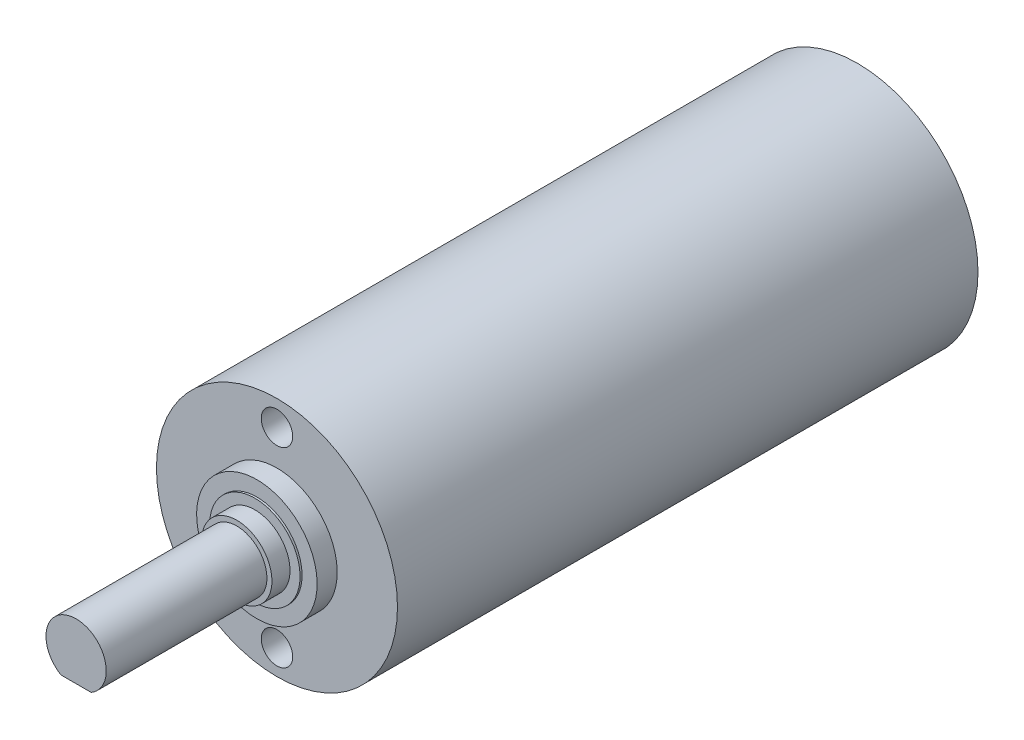
ISO-10303-21;
HEADER;
FILE_DESCRIPTION(('STEP AP214'),'2;1');
FILE_NAME('part.step','',(''),(''),'','','');
FILE_SCHEMA(('AUTOMOTIVE_DESIGN { 1 0 10303 214 1 1 1 1 }'));
ENDSEC;
DATA;
#1=APPLICATION_CONTEXT('core data for automotive mechanical design processes');
#2=APPLICATION_PROTOCOL_DEFINITION('international standard','automotive_design',2000,#1);
#3=PRODUCT_CONTEXT('',#1,'mechanical');
#4=PRODUCT('Part','Part','',(#3));
#5=PRODUCT_RELATED_PRODUCT_CATEGORY('part','',(#4));
#6=PRODUCT_DEFINITION_FORMATION('','',#4);
#7=PRODUCT_DEFINITION_CONTEXT('part definition',#1,'design');
#8=PRODUCT_DEFINITION('design','',#6,#7);
#9=PRODUCT_DEFINITION_SHAPE('','',#8);
#10=(LENGTH_UNIT() NAMED_UNIT(*) SI_UNIT(.MILLI.,.METRE.));
#11=(NAMED_UNIT(*) PLANE_ANGLE_UNIT() SI_UNIT($,.RADIAN.));
#12=(NAMED_UNIT(*) SI_UNIT($,.STERADIAN.) SOLID_ANGLE_UNIT());
#13=UNCERTAINTY_MEASURE_WITH_UNIT(LENGTH_MEASURE(1.E-05),#10,'distance_accuracy_value','');
#14=(GEOMETRIC_REPRESENTATION_CONTEXT(3) GLOBAL_UNCERTAINTY_ASSIGNED_CONTEXT((#13)) GLOBAL_UNIT_ASSIGNED_CONTEXT((#10,
#11,#12)) REPRESENTATION_CONTEXT('',''));
#15=CARTESIAN_POINT('',(0.,0.,0.));
#16=DIRECTION('',(0.,0.,1.));
#17=DIRECTION('',(1.,0.,0.));
#18=AXIS2_PLACEMENT_3D('',#15,#16,#17);
#19=CARTESIAN_POINT('',(0.,4.75,-1.));
#20=DIRECTION('',(0.,0.,-1.));
#21=DIRECTION('',(1.,0.,0.));
#22=AXIS2_PLACEMENT_3D('',#19,#20,#21);
#23=CYLINDRICAL_SURFACE('',#22,0.7835);
#24=CARTESIAN_POINT('',(0.,4.75,0.));
#25=DIRECTION('',(0.,0.,-1.));
#26=DIRECTION('',(1.,0.,0.));
#27=AXIS2_PLACEMENT_3D('',#24,#25,#26);
#28=CIRCLE('',#27,0.7835);
#29=CARTESIAN_POINT('',(0.7835,4.75,0.));
#30=VERTEX_POINT('',#29);
#31=EDGE_CURVE('E39',#30,#30,#28,.T.);
#32=ORIENTED_EDGE('',*,*,#31,.F.);
#33=EDGE_LOOP('',(#32));
#34=FACE_BOUND('',#33,.T.);
#35=CARTESIAN_POINT('',(0.,4.75,-2.));
#36=DIRECTION('',(0.,0.,-1.));
#37=DIRECTION('',(1.,0.,0.));
#38=AXIS2_PLACEMENT_3D('',#35,#36,#37);
#39=CIRCLE('',#38,0.7835);
#40=CARTESIAN_POINT('',(0.7835,4.75,-2.));
#41=VERTEX_POINT('',#40);
#42=EDGE_CURVE('E11',#41,#41,#39,.T.);
#43=ORIENTED_EDGE('',*,*,#42,.T.);
#44=EDGE_LOOP('',(#43));
#45=FACE_BOUND('',#44,.T.);
#46=ADVANCED_FACE('F16',(#34,#45),#23,.F.);
#47=CARTESIAN_POINT('',(0.,4.75,-2.));
#48=DIRECTION('',(0.,0.,-1.));
#49=DIRECTION('',(0.,-1.,0.));
#50=AXIS2_PLACEMENT_3D('',#47,#48,#49);
#51=PLANE('',#50);
#52=ORIENTED_EDGE('',*,*,#42,.F.);
#53=EDGE_LOOP('',(#52));
#54=FACE_BOUND('',#53,.T.);
#55=ADVANCED_FACE('F189',(#54),#51,.F.);
#56=CARTESIAN_POINT('',(0.,-4.75,-1.));
#57=DIRECTION('',(0.,0.,1.));
#58=DIRECTION('',(1.,0.,0.));
#59=AXIS2_PLACEMENT_3D('',#56,#57,#58);
#60=CYLINDRICAL_SURFACE('',#59,0.7835);
#61=CARTESIAN_POINT('',(0.,-4.75,0.));
#62=DIRECTION('',(0.,0.,-1.));
#63=DIRECTION('',(1.,0.,0.));
#64=AXIS2_PLACEMENT_3D('',#61,#62,#63);
#65=CIRCLE('',#64,0.7835);
#66=CARTESIAN_POINT('',(0.7835,-4.75,0.));
#67=VERTEX_POINT('',#66);
#68=EDGE_CURVE('E151',#67,#67,#65,.T.);
#69=ORIENTED_EDGE('',*,*,#68,.F.);
#70=EDGE_LOOP('',(#69));
#71=FACE_BOUND('',#70,.T.);
#72=CARTESIAN_POINT('',(0.,-4.75,-2.));
#73=DIRECTION('',(0.,0.,1.));
#74=DIRECTION('',(1.,0.,0.));
#75=AXIS2_PLACEMENT_3D('',#72,#73,#74);
#76=CIRCLE('',#75,0.7835);
#77=CARTESIAN_POINT('',(0.7835,-4.75,-2.));
#78=VERTEX_POINT('',#77);
#79=EDGE_CURVE('E27',#78,#78,#76,.T.);
#80=ORIENTED_EDGE('',*,*,#79,.F.);
#81=EDGE_LOOP('',(#80));
#82=FACE_BOUND('',#81,.T.);
#83=ADVANCED_FACE('F194',(#71,#82),#60,.F.);
#84=CARTESIAN_POINT('',(0.,-4.75,-2.));
#85=DIRECTION('',(0.,0.,1.));
#86=DIRECTION('',(1.,0.,0.));
#87=AXIS2_PLACEMENT_3D('',#84,#85,#86);
#88=PLANE('',#87);
#89=ORIENTED_EDGE('',*,*,#79,.T.);
#90=EDGE_LOOP('',(#89));
#91=FACE_BOUND('',#90,.T.);
#92=ADVANCED_FACE('F201',(#91),#88,.T.);
#93=CARTESIAN_POINT('',(0.,-1.3,4.));
#94=DIRECTION('',(0.,0.,-1.));
#95=DIRECTION('',(0.,-1.,0.));
#96=AXIS2_PLACEMENT_3D('',#93,#94,#95);
#97=PLANE('',#96);
#98=CARTESIAN_POINT('',(0.,0.,4.));
#99=DIRECTION('',(0.,0.,-1.));
#100=DIRECTION('',(0.,-1.,0.));
#101=AXIS2_PLACEMENT_3D('',#98,#99,#100);
#102=CIRCLE('',#101,1.5);
#103=CARTESIAN_POINT('',(0.748331477354788,-1.3,4.));
#104=VERTEX_POINT('',#103);
#105=CARTESIAN_POINT('',(-0.748331477354788,-1.3,4.));
#106=VERTEX_POINT('',#105);
#107=EDGE_CURVE('E107',#104,#106,#102,.T.);
#108=ORIENTED_EDGE('',*,*,#107,.F.);
#109=DIRECTION('',(-1.,0.,0.));
#110=VECTOR('',#109,1.);
#111=CARTESIAN_POINT('',(0.748331477354788,-1.3,4.));
#112=LINE('',#111,#110);
#113=EDGE_CURVE('E120',#104,#106,#112,.T.);
#114=ORIENTED_EDGE('',*,*,#113,.T.);
#115=EDGE_LOOP('',(#108,#114));
#116=FACE_BOUND('',#115,.T.);
#117=ADVANCED_FACE('F18',(#116),#97,.F.);
#118=CARTESIAN_POINT('',(0.,-1.3,10.));
#119=DIRECTION('',(0.,1.,0.));
#120=DIRECTION('',(1.,0.,0.));
#121=AXIS2_PLACEMENT_3D('',#118,#119,#120);
#122=PLANE('',#121);
#123=DIRECTION('',(0.,0.,1.));
#124=VECTOR('',#123,1.);
#125=CARTESIAN_POINT('',(-0.748331477354788,-1.3,4.));
#126=LINE('',#125,#124);
#127=CARTESIAN_POINT('',(-0.748331477354787,-1.3,10.));
#128=VERTEX_POINT('',#127);
#129=EDGE_CURVE('E20',#106,#128,#126,.T.);
#130=ORIENTED_EDGE('',*,*,#129,.F.);
#131=ORIENTED_EDGE('',*,*,#113,.F.);
#132=DIRECTION('',(0.,0.,-1.));
#133=VECTOR('',#132,1.);
#134=CARTESIAN_POINT('',(0.748331477354788,-1.3,10.));
#135=LINE('',#134,#133);
#136=CARTESIAN_POINT('',(0.748331477354787,-1.3,10.));
#137=VERTEX_POINT('',#136);
#138=EDGE_CURVE('E114',#137,#104,#135,.T.);
#139=ORIENTED_EDGE('',*,*,#138,.F.);
#140=DIRECTION('',(1.,0.,0.));
#141=VECTOR('',#140,1.);
#142=CARTESIAN_POINT('',(-0.748331477354787,-1.3,10.));
#143=LINE('',#142,#141);
#144=EDGE_CURVE('E123',#128,#137,#143,.T.);
#145=ORIENTED_EDGE('',*,*,#144,.F.);
#146=EDGE_LOOP('',(#130,#131,#139,#145));
#147=FACE_BOUND('',#146,.T.);
#148=ADVANCED_FACE('F125',(#147),#122,.F.);
#149=CARTESIAN_POINT('',(0.,-0.75,10.));
#150=DIRECTION('',(0.,0.,1.));
#151=DIRECTION('',(1.,0.,0.));
#152=AXIS2_PLACEMENT_3D('',#149,#150,#151);
#153=PLANE('',#152);
#154=ORIENTED_EDGE('',*,*,#144,.T.);
#155=CARTESIAN_POINT('',(0.,0.,10.));
#156=DIRECTION('',(0.,0.,1.));
#157=DIRECTION('',(0.,-1.,0.));
#158=AXIS2_PLACEMENT_3D('',#155,#156,#157);
#159=CIRCLE('',#158,1.5);
#160=EDGE_CURVE('E233',#137,#128,#159,.T.);
#161=ORIENTED_EDGE('',*,*,#160,.T.);
#162=EDGE_LOOP('',(#154,#161));
#163=FACE_BOUND('',#162,.T.);
#164=ADVANCED_FACE('F245',(#163),#153,.T.);
#165=CARTESIAN_POINT('',(0.,-3.,-28.9));
#166=DIRECTION('',(0.,0.,-1.));
#167=DIRECTION('',(0.,-1.,0.));
#168=AXIS2_PLACEMENT_3D('',#165,#166,#167);
#169=PLANE('',#168);
#170=CARTESIAN_POINT('',(0.,0.,-28.9));
#171=DIRECTION('',(0.,0.,1.));
#172=DIRECTION('',(0.,-1.,0.));
#173=AXIS2_PLACEMENT_3D('',#170,#171,#172);
#174=CIRCLE('',#173,6.);
#175=CARTESIAN_POINT('',(0.,-6.,-28.9));
#176=VERTEX_POINT('',#175);
#177=EDGE_CURVE('E229',#176,#176,#174,.T.);
#178=ORIENTED_EDGE('',*,*,#177,.F.);
#179=EDGE_LOOP('',(#178));
#180=FACE_BOUND('',#179,.T.);
#181=ADVANCED_FACE('F247',(#180),#169,.T.);
#182=CARTESIAN_POINT('',(0.,0.,-14.45));
#183=DIRECTION('',(0.,0.,1.));
#184=DIRECTION('',(0.,-1.,0.));
#185=AXIS2_PLACEMENT_3D('',#182,#183,#184);
#186=CYLINDRICAL_SURFACE('',#185,6.);
#187=CARTESIAN_POINT('',(0.,0.,0.));
#188=DIRECTION('',(0.,0.,1.));
#189=DIRECTION('',(0.,-1.,0.));
#190=AXIS2_PLACEMENT_3D('',#187,#188,#189);
#191=CIRCLE('',#190,6.);
#192=CARTESIAN_POINT('',(0.,-6.,0.));
#193=VERTEX_POINT('',#192);
#194=EDGE_CURVE('E84',#193,#193,#191,.T.);
#195=ORIENTED_EDGE('',*,*,#194,.F.);
#196=EDGE_LOOP('',(#195));
#197=FACE_BOUND('',#196,.T.);
#198=ORIENTED_EDGE('',*,*,#177,.T.);
#199=EDGE_LOOP('',(#198));
#200=FACE_BOUND('',#199,.T.);
#201=ADVANCED_FACE('F218',(#197,#200),#186,.T.);
#202=CARTESIAN_POINT('',(0.,-4.5,0.));
#203=DIRECTION('',(0.,0.,1.));
#204=DIRECTION('',(1.,0.,0.));
#205=AXIS2_PLACEMENT_3D('',#202,#203,#204);
#206=PLANE('',#205);
#207=ORIENTED_EDGE('',*,*,#194,.T.);
#208=EDGE_LOOP('',(#207));
#209=FACE_BOUND('',#208,.T.);
#210=ORIENTED_EDGE('',*,*,#31,.T.);
#211=EDGE_LOOP('',(#210));
#212=FACE_BOUND('',#211,.T.);
#213=ORIENTED_EDGE('',*,*,#68,.T.);
#214=EDGE_LOOP('',(#213));
#215=FACE_BOUND('',#214,.T.);
#216=CARTESIAN_POINT('',(0.,0.,0.));
#217=DIRECTION('',(0.,0.,1.));
#218=DIRECTION('',(0.,-1.,0.));
#219=AXIS2_PLACEMENT_3D('',#216,#217,#218);
#220=CIRCLE('',#219,3.);
#221=CARTESIAN_POINT('',(0.,-3.,0.));
#222=VERTEX_POINT('',#221);
#223=EDGE_CURVE('E92',#222,#222,#220,.T.);
#224=ORIENTED_EDGE('',*,*,#223,.F.);
#225=EDGE_LOOP('',(#224));
#226=FACE_BOUND('',#225,.T.);
#227=ADVANCED_FACE('F210',(#209,#212,#215,#226),#206,.T.);
#228=CARTESIAN_POINT('',(0.,0.,0.5));
#229=DIRECTION('',(0.,0.,1.));
#230=DIRECTION('',(0.,-1.,0.));
#231=AXIS2_PLACEMENT_3D('',#228,#229,#230);
#232=CYLINDRICAL_SURFACE('',#231,3.);
#233=CARTESIAN_POINT('',(0.,0.,1.));
#234=DIRECTION('',(0.,0.,1.));
#235=DIRECTION('',(0.,-1.,0.));
#236=AXIS2_PLACEMENT_3D('',#233,#234,#235);
#237=CIRCLE('',#236,3.);
#238=CARTESIAN_POINT('',(0.,-3.,1.));
#239=VERTEX_POINT('',#238);
#240=EDGE_CURVE('E147',#239,#239,#237,.T.);
#241=ORIENTED_EDGE('',*,*,#240,.F.);
#242=EDGE_LOOP('',(#241));
#243=FACE_BOUND('',#242,.T.);
#244=ORIENTED_EDGE('',*,*,#223,.T.);
#245=EDGE_LOOP('',(#244));
#246=FACE_BOUND('',#245,.T.);
#247=ADVANCED_FACE('F207',(#243,#246),#232,.T.);
#248=CARTESIAN_POINT('',(0.,-2.625,1.));
#249=DIRECTION('',(0.,0.,1.));
#250=DIRECTION('',(1.,0.,0.));
#251=AXIS2_PLACEMENT_3D('',#248,#249,#250);
#252=PLANE('',#251);
#253=ORIENTED_EDGE('',*,*,#240,.T.);
#254=EDGE_LOOP('',(#253));
#255=FACE_BOUND('',#254,.T.);
#256=CARTESIAN_POINT('',(0.,0.,1.));
#257=DIRECTION('',(0.,0.,1.));
#258=DIRECTION('',(0.,-1.,0.));
#259=AXIS2_PLACEMENT_3D('',#256,#257,#258);
#260=CIRCLE('',#259,2.25);
#261=CARTESIAN_POINT('',(0.,-2.25,1.));
#262=VERTEX_POINT('',#261);
#263=EDGE_CURVE('E143',#262,#262,#260,.T.);
#264=ORIENTED_EDGE('',*,*,#263,.F.);
#265=EDGE_LOOP('',(#264));
#266=FACE_BOUND('',#265,.T.);
#267=ADVANCED_FACE('F209',(#255,#266),#252,.T.);
#268=CARTESIAN_POINT('',(0.,0.,1.05));
#269=DIRECTION('',(0.,0.,1.));
#270=DIRECTION('',(0.,-1.,0.));
#271=AXIS2_PLACEMENT_3D('',#268,#269,#270);
#272=CYLINDRICAL_SURFACE('',#271,2.25);
#273=CARTESIAN_POINT('',(0.,0.,1.1));
#274=DIRECTION('',(0.,0.,1.));
#275=DIRECTION('',(0.,-1.,0.));
#276=AXIS2_PLACEMENT_3D('',#273,#274,#275);
#277=CIRCLE('',#276,2.25);
#278=CARTESIAN_POINT('',(0.,-2.25,1.1));
#279=VERTEX_POINT('',#278);
#280=EDGE_CURVE('E148',#279,#279,#277,.T.);
#281=ORIENTED_EDGE('',*,*,#280,.F.);
#282=EDGE_LOOP('',(#281));
#283=FACE_BOUND('',#282,.T.);
#284=ORIENTED_EDGE('',*,*,#263,.T.);
#285=EDGE_LOOP('',(#284));
#286=FACE_BOUND('',#285,.T.);
#287=ADVANCED_FACE('F206',(#283,#286),#272,.T.);
#288=CARTESIAN_POINT('',(0.,-2.,1.1));
#289=DIRECTION('',(0.,0.,1.));
#290=DIRECTION('',(1.,0.,0.));
#291=AXIS2_PLACEMENT_3D('',#288,#289,#290);
#292=PLANE('',#291);
#293=ORIENTED_EDGE('',*,*,#280,.T.);
#294=EDGE_LOOP('',(#293));
#295=FACE_BOUND('',#294,.T.);
#296=CARTESIAN_POINT('',(0.,0.,1.1));
#297=DIRECTION('',(0.,0.,1.));
#298=DIRECTION('',(0.,-1.,0.));
#299=AXIS2_PLACEMENT_3D('',#296,#297,#298);
#300=CIRCLE('',#299,1.75);
#301=CARTESIAN_POINT('',(0.,-1.75,1.1));
#302=VERTEX_POINT('',#301);
#303=EDGE_CURVE('E136',#302,#302,#300,.T.);
#304=ORIENTED_EDGE('',*,*,#303,.F.);
#305=EDGE_LOOP('',(#304));
#306=FACE_BOUND('',#305,.T.);
#307=ADVANCED_FACE('F184',(#295,#306),#292,.T.);
#308=CARTESIAN_POINT('',(0.,0.,1.55));
#309=DIRECTION('',(0.,0.,1.));
#310=DIRECTION('',(0.,-1.,0.));
#311=AXIS2_PLACEMENT_3D('',#308,#309,#310);
#312=CYLINDRICAL_SURFACE('',#311,1.75);
#313=CARTESIAN_POINT('',(0.,0.,2.));
#314=DIRECTION('',(0.,0.,1.));
#315=DIRECTION('',(0.,-1.,0.));
#316=AXIS2_PLACEMENT_3D('',#313,#314,#315);
#317=CIRCLE('',#316,1.75);
#318=CARTESIAN_POINT('',(0.,-1.75,2.));
#319=VERTEX_POINT('',#318);
#320=EDGE_CURVE('E129',#319,#319,#317,.T.);
#321=ORIENTED_EDGE('',*,*,#320,.F.);
#322=EDGE_LOOP('',(#321));
#323=FACE_BOUND('',#322,.T.);
#324=ORIENTED_EDGE('',*,*,#303,.T.);
#325=EDGE_LOOP('',(#324));
#326=FACE_BOUND('',#325,.T.);
#327=ADVANCED_FACE('F175',(#323,#326),#312,.T.);
#328=CARTESIAN_POINT('',(0.,-1.625,2.));
#329=DIRECTION('',(0.,0.,1.));
#330=DIRECTION('',(1.,0.,0.));
#331=AXIS2_PLACEMENT_3D('',#328,#329,#330);
#332=PLANE('',#331);
#333=ORIENTED_EDGE('',*,*,#320,.T.);
#334=EDGE_LOOP('',(#333));
#335=FACE_BOUND('',#334,.T.);
#336=CARTESIAN_POINT('',(0.,0.,2.));
#337=DIRECTION('',(0.,0.,1.));
#338=DIRECTION('',(0.,-1.,0.));
#339=AXIS2_PLACEMENT_3D('',#336,#337,#338);
#340=CIRCLE('',#339,1.5);
#341=CARTESIAN_POINT('',(0.,-1.5,2.));
#342=VERTEX_POINT('',#341);
#343=EDGE_CURVE('E118',#342,#342,#340,.T.);
#344=ORIENTED_EDGE('',*,*,#343,.F.);
#345=EDGE_LOOP('',(#344));
#346=FACE_BOUND('',#345,.T.);
#347=ADVANCED_FACE('F173',(#335,#346),#332,.T.);
#348=CARTESIAN_POINT('',(0.,0.,6.));
#349=DIRECTION('',(0.,0.,1.));
#350=DIRECTION('',(0.,-1.,0.));
#351=AXIS2_PLACEMENT_3D('',#348,#349,#350);
#352=CYLINDRICAL_SURFACE('',#351,1.5);
#353=ORIENTED_EDGE('',*,*,#129,.T.);
#354=ORIENTED_EDGE('',*,*,#160,.F.);
#355=ORIENTED_EDGE('',*,*,#138,.T.);
#356=ORIENTED_EDGE('',*,*,#107,.T.);
#357=EDGE_LOOP('',(#353,#354,#355,#356));
#358=FACE_BOUND('',#357,.T.);
#359=ORIENTED_EDGE('',*,*,#343,.T.);
#360=EDGE_LOOP('',(#359));
#361=FACE_BOUND('',#360,.T.);
#362=ADVANCED_FACE('F109',(#358,#361),#352,.T.);
#363=CLOSED_SHELL('',(#46,#55,#83,#92,#117,#148,#164,#181,#201,#227,#247,#267,#287,#307,#327,
#347,#362));
#364=MANIFOLD_SOLID_BREP('B1',#363);
#365=ADVANCED_BREP_SHAPE_REPRESENTATION('',(#18,#364),#14);
#366=SHAPE_DEFINITION_REPRESENTATION(#9,#365);
ENDSEC;
END-ISO-10303-21;
